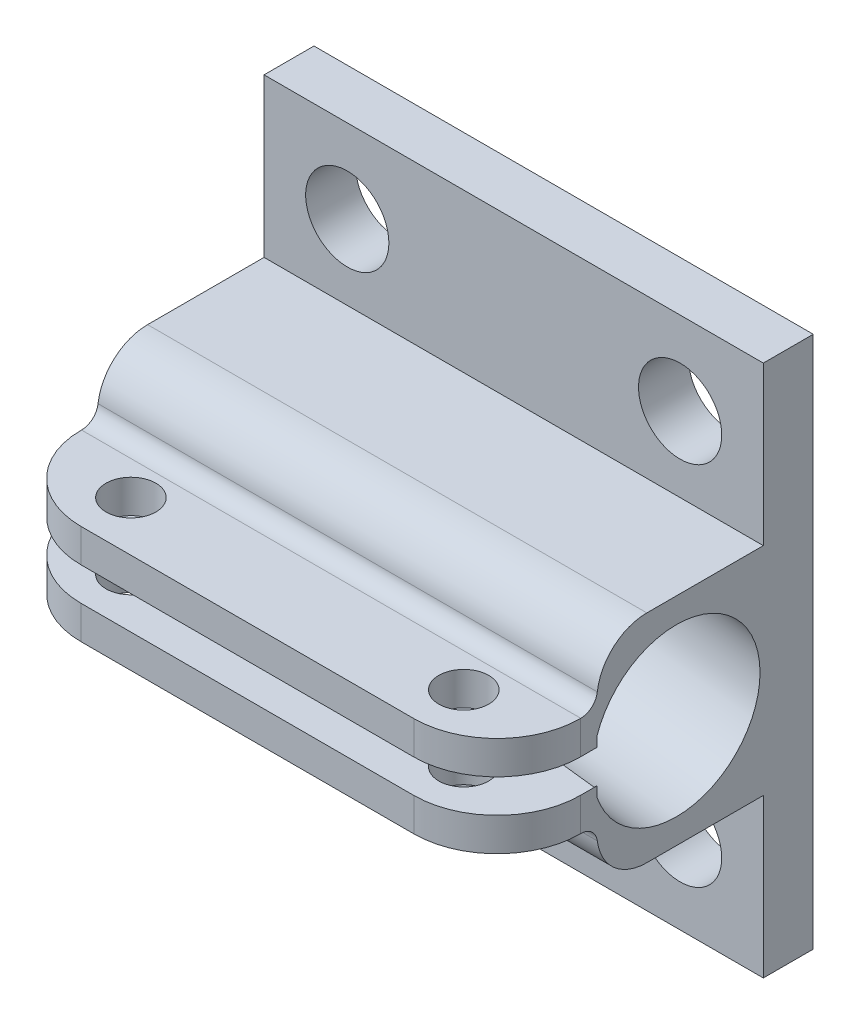
ISO-10303-21;
HEADER;
FILE_DESCRIPTION(('STEP AP214'),'2;1');
FILE_NAME('part.step','',(''),(''),'','','');
FILE_SCHEMA(('AUTOMOTIVE_DESIGN { 1 0 10303 214 1 1 1 1 }'));
ENDSEC;
DATA;
#1=APPLICATION_CONTEXT('core data for automotive mechanical design processes');
#2=APPLICATION_PROTOCOL_DEFINITION('international standard','automotive_design',2000,#1);
#3=PRODUCT_CONTEXT('',#1,'mechanical');
#4=PRODUCT('Part','Part','',(#3));
#5=PRODUCT_RELATED_PRODUCT_CATEGORY('part','',(#4));
#6=PRODUCT_DEFINITION_FORMATION('','',#4);
#7=PRODUCT_DEFINITION_CONTEXT('part definition',#1,'design');
#8=PRODUCT_DEFINITION('design','',#6,#7);
#9=PRODUCT_DEFINITION_SHAPE('','',#8);
#10=(LENGTH_UNIT() NAMED_UNIT(*) SI_UNIT(.MILLI.,.METRE.));
#11=(NAMED_UNIT(*) PLANE_ANGLE_UNIT() SI_UNIT($,.RADIAN.));
#12=(NAMED_UNIT(*) SI_UNIT($,.STERADIAN.) SOLID_ANGLE_UNIT());
#13=UNCERTAINTY_MEASURE_WITH_UNIT(LENGTH_MEASURE(1.E-05),#10,'distance_accuracy_value','');
#14=(GEOMETRIC_REPRESENTATION_CONTEXT(3) GLOBAL_UNCERTAINTY_ASSIGNED_CONTEXT((#13)) GLOBAL_UNIT_ASSIGNED_CONTEXT((#10,
#11,#12)) REPRESENTATION_CONTEXT('',''));
#15=CARTESIAN_POINT('',(0.,0.,0.));
#16=DIRECTION('',(0.,0.,1.));
#17=DIRECTION('',(1.,0.,0.));
#18=AXIS2_PLACEMENT_3D('',#15,#16,#17);
#19=CARTESIAN_POINT('',(-25.,16.26211357,66.8));
#20=DIRECTION('',(0.,1.,0.));
#21=DIRECTION('',(0.,0.,1.));
#22=AXIS2_PLACEMENT_3D('',#19,#20,#21);
#23=CYLINDRICAL_SURFACE('',#22,1.5);
#24=CARTESIAN_POINT('',(-25.,18.26211357,66.8));
#25=DIRECTION('',(0.,1.,0.));
#26=DIRECTION('',(0.,0.,1.));
#27=AXIS2_PLACEMENT_3D('',#24,#25,#26);
#28=CIRCLE('',#27,1.5);
#29=CARTESIAN_POINT('',(-25.,18.26211357,68.3));
#30=VERTEX_POINT('',#29);
#31=EDGE_CURVE('E28',#30,#30,#28,.T.);
#32=ORIENTED_EDGE('',*,*,#31,.T.);
#33=EDGE_LOOP('',(#32));
#34=FACE_BOUND('',#33,.T.);
#35=CARTESIAN_POINT('',(-25.,16.26211357,66.8));
#36=DIRECTION('',(0.,1.,0.));
#37=DIRECTION('',(0.,0.,1.));
#38=AXIS2_PLACEMENT_3D('',#35,#36,#37);
#39=CIRCLE('',#38,1.5);
#40=CARTESIAN_POINT('',(-25.,16.26211357,68.3));
#41=VERTEX_POINT('',#40);
#42=EDGE_CURVE('E260',#41,#41,#39,.F.);
#43=ORIENTED_EDGE('',*,*,#42,.T.);
#44=EDGE_LOOP('',(#43));
#45=FACE_BOUND('',#44,.T.);
#46=ADVANCED_FACE('F25',(#34,#45),#23,.F.);
#47=CARTESIAN_POINT('',(-5.,16.26211357,66.8));
#48=DIRECTION('',(0.,1.,0.));
#49=DIRECTION('',(0.,0.,1.));
#50=AXIS2_PLACEMENT_3D('',#47,#48,#49);
#51=CYLINDRICAL_SURFACE('',#50,1.5);
#52=CARTESIAN_POINT('',(-5.,18.26211357,66.8));
#53=DIRECTION('',(0.,1.,0.));
#54=DIRECTION('',(0.,0.,1.));
#55=AXIS2_PLACEMENT_3D('',#52,#53,#54);
#56=CIRCLE('',#55,1.5);
#57=CARTESIAN_POINT('',(-5.,18.26211357,68.3));
#58=VERTEX_POINT('',#57);
#59=EDGE_CURVE('E169',#58,#58,#56,.T.);
#60=ORIENTED_EDGE('',*,*,#59,.T.);
#61=EDGE_LOOP('',(#60));
#62=FACE_BOUND('',#61,.T.);
#63=CARTESIAN_POINT('',(-5.,16.26211357,66.8));
#64=DIRECTION('',(0.,1.,0.));
#65=DIRECTION('',(0.,0.,1.));
#66=AXIS2_PLACEMENT_3D('',#63,#64,#65);
#67=CIRCLE('',#66,1.5);
#68=CARTESIAN_POINT('',(-5.,16.26211357,68.3));
#69=VERTEX_POINT('',#68);
#70=EDGE_CURVE('E257',#69,#69,#67,.F.);
#71=ORIENTED_EDGE('',*,*,#70,.T.);
#72=EDGE_LOOP('',(#71));
#73=FACE_BOUND('',#72,.T.);
#74=ADVANCED_FACE('F628',(#62,#73),#51,.F.);
#75=CARTESIAN_POINT('',(0.,0.,69.8));
#76=DIRECTION('',(0.,0.,1.));
#77=DIRECTION('',(1.,0.,0.));
#78=AXIS2_PLACEMENT_3D('',#75,#76,#77);
#79=PLANE('',#78);
#80=DIRECTION('',(0.,1.,0.));
#81=VECTOR('',#80,1.);
#82=CARTESIAN_POINT('',(-5.,17.26211357,69.8));
#83=LINE('',#82,#81);
#84=CARTESIAN_POINT('',(-5.,16.26211357,69.8));
#85=VERTEX_POINT('',#84);
#86=CARTESIAN_POINT('',(-5.,18.26211357,69.8));
#87=VERTEX_POINT('',#86);
#88=EDGE_CURVE('E252',#85,#87,#83,.T.);
#89=ORIENTED_EDGE('',*,*,#88,.T.);
#90=DIRECTION('',(1.,0.,0.));
#91=VECTOR('',#90,1.);
#92=CARTESIAN_POINT('',(0.,18.26211357,69.8));
#93=LINE('',#92,#91);
#94=CARTESIAN_POINT('',(-25.,18.26211357,69.8));
#95=VERTEX_POINT('',#94);
#96=EDGE_CURVE('E286',#87,#95,#93,.F.);
#97=ORIENTED_EDGE('',*,*,#96,.T.);
#98=DIRECTION('',(0.,-1.,0.));
#99=VECTOR('',#98,1.);
#100=CARTESIAN_POINT('',(-25.,17.26211357,69.8));
#101=LINE('',#100,#99);
#102=CARTESIAN_POINT('',(-25.,16.26211357,69.8));
#103=VERTEX_POINT('',#102);
#104=EDGE_CURVE('E268',#95,#103,#101,.T.);
#105=ORIENTED_EDGE('',*,*,#104,.T.);
#106=DIRECTION('',(1.,0.,0.));
#107=VECTOR('',#106,1.);
#108=CARTESIAN_POINT('',(0.,16.26211357,69.8));
#109=LINE('',#108,#107);
#110=EDGE_CURVE('E267',#103,#85,#109,.T.);
#111=ORIENTED_EDGE('',*,*,#110,.T.);
#112=EDGE_LOOP('',(#89,#97,#105,#111));
#113=FACE_BOUND('',#112,.T.);
#114=ADVANCED_FACE('F625',(#113),#79,.T.);
#115=CARTESIAN_POINT('',(0.,18.26211357,0.));
#116=DIRECTION('',(0.,1.,0.));
#117=DIRECTION('',(0.,0.,1.));
#118=AXIS2_PLACEMENT_3D('',#115,#116,#117);
#119=PLANE('',#118);
#120=ORIENTED_EDGE('',*,*,#59,.F.);
#121=EDGE_LOOP('',(#120));
#122=FACE_BOUND('',#121,.T.);
#123=ORIENTED_EDGE('',*,*,#31,.F.);
#124=EDGE_LOOP('',(#123));
#125=FACE_BOUND('',#124,.T.);
#126=CARTESIAN_POINT('',(-25.,18.26211357,64.8));
#127=DIRECTION('',(0.,1.,0.));
#128=DIRECTION('',(0.,0.,1.));
#129=AXIS2_PLACEMENT_3D('',#126,#127,#128);
#130=CIRCLE('',#129,5.);
#131=CARTESIAN_POINT('',(-30.,18.26211357,64.8));
#132=VERTEX_POINT('',#131);
#133=EDGE_CURVE('E269',#132,#95,#130,.T.);
#134=ORIENTED_EDGE('',*,*,#133,.T.);
#135=ORIENTED_EDGE('',*,*,#96,.F.);
#136=CARTESIAN_POINT('',(-5.,18.26211357,64.8));
#137=DIRECTION('',(0.,1.,0.));
#138=DIRECTION('',(0.,0.,1.));
#139=AXIS2_PLACEMENT_3D('',#136,#137,#138);
#140=CIRCLE('',#139,5.);
#141=CARTESIAN_POINT('',(0.,18.26211357,64.8));
#142=VERTEX_POINT('',#141);
#143=EDGE_CURVE('E178',#87,#142,#140,.T.);
#144=ORIENTED_EDGE('',*,*,#143,.T.);
#145=DIRECTION('',(0.,0.,1.));
#146=VECTOR('',#145,1.);
#147=CARTESIAN_POINT('',(0.,18.26211357,0.));
#148=LINE('',#147,#146);
#149=CARTESIAN_POINT('',(0.,18.2621135658573,64.76862697));
#150=VERTEX_POINT('',#149);
#151=EDGE_CURVE('E290',#150,#142,#148,.T.);
#152=ORIENTED_EDGE('',*,*,#151,.F.);
#153=DIRECTION('',(1.,0.,0.));
#154=VECTOR('',#153,1.);
#155=CARTESIAN_POINT('',(-15.,18.2621135617147,64.76862697));
#156=LINE('',#155,#154);
#157=CARTESIAN_POINT('',(-30.,18.2621135658573,64.76862697));
#158=VERTEX_POINT('',#157);
#159=EDGE_CURVE('E165',#150,#158,#156,.F.);
#160=ORIENTED_EDGE('',*,*,#159,.T.);
#161=DIRECTION('',(0.,0.,1.));
#162=VECTOR('',#161,1.);
#163=CARTESIAN_POINT('',(-30.,18.26211357,0.));
#164=LINE('',#163,#162);
#165=EDGE_CURVE('E283',#132,#158,#164,.F.);
#166=ORIENTED_EDGE('',*,*,#165,.F.);
#167=EDGE_LOOP('',(#134,#135,#144,#152,#160,#166));
#168=FACE_BOUND('',#167,.T.);
#169=ADVANCED_FACE('F622',(#122,#125,#168),#119,.T.);
#170=CARTESIAN_POINT('',(0.,19.26211357,64.76862697));
#171=DIRECTION('',(-1.,0.,0.));
#172=DIRECTION('',(0.,0.,1.));
#173=AXIS2_PLACEMENT_3D('',#170,#171,#172);
#174=CYLINDRICAL_SURFACE('',#173,1.00000000828529);
#175=CARTESIAN_POINT('',(-30.,19.26211357,64.76862697));
#176=DIRECTION('',(-1.,0.,0.));
#177=DIRECTION('',(0.,0.,1.));
#178=AXIS2_PLACEMENT_3D('',#175,#176,#177);
#179=CIRCLE('',#178,1.00000000828529);
#180=CARTESIAN_POINT('',(-30.,19.1371135698417,63.7764702224938));
#181=VERTEX_POINT('',#180);
#182=EDGE_CURVE('E278',#158,#181,#179,.F.);
#183=ORIENTED_EDGE('',*,*,#182,.F.);
#184=ORIENTED_EDGE('',*,*,#159,.F.);
#185=CARTESIAN_POINT('',(0.,19.26211357,64.76862697));
#186=DIRECTION('',(-1.,0.,0.));
#187=DIRECTION('',(0.,0.,1.));
#188=AXIS2_PLACEMENT_3D('',#185,#186,#187);
#189=CIRCLE('',#188,1.00000000828529);
#190=CARTESIAN_POINT('',(0.,19.1371135698417,63.7764702224938));
#191=VERTEX_POINT('',#190);
#192=EDGE_CURVE('E158',#191,#150,#189,.T.);
#193=ORIENTED_EDGE('',*,*,#192,.F.);
#194=DIRECTION('',(-1.,0.,0.));
#195=VECTOR('',#194,1.);
#196=CARTESIAN_POINT('',(-15.,19.1371135706136,63.7764702248704));
#197=LINE('',#196,#195);
#198=EDGE_CURVE('E162',#191,#181,#197,.T.);
#199=ORIENTED_EDGE('',*,*,#198,.T.);
#200=EDGE_LOOP('',(#183,#184,#193,#199));
#201=FACE_BOUND('',#200,.T.);
#202=ADVANCED_FACE('F161',(#201),#174,.F.);
#203=CARTESIAN_POINT('',(0.,11.26211357,64.76862697));
#204=DIRECTION('',(-1.,0.,0.));
#205=DIRECTION('',(0.,0.,1.));
#206=AXIS2_PLACEMENT_3D('',#203,#204,#205);
#207=CYLINDRICAL_SURFACE('',#206,0.999999999999999);
#208=CARTESIAN_POINT('',(0.,11.26211357,64.76862697));
#209=DIRECTION('',(-1.,0.,0.));
#210=DIRECTION('',(0.,0.,1.));
#211=AXIS2_PLACEMENT_3D('',#208,#209,#210);
#212=CIRCLE('',#211,0.999999999999999);
#213=CARTESIAN_POINT('',(0.,12.26211357,64.76862697));
#214=VERTEX_POINT('',#213);
#215=CARTESIAN_POINT('',(0.,11.3871135699472,63.7764702241688));
#216=VERTEX_POINT('',#215);
#217=EDGE_CURVE('E273',#214,#216,#212,.T.);
#218=ORIENTED_EDGE('',*,*,#217,.F.);
#219=DIRECTION('',(1.,0.,0.));
#220=VECTOR('',#219,1.);
#221=CARTESIAN_POINT('',(0.,12.26211357,64.76862697));
#222=LINE('',#221,#220);
#223=CARTESIAN_POINT('',(-30.,12.26211357,64.76862697));
#224=VERTEX_POINT('',#223);
#225=EDGE_CURVE('E272',#214,#224,#222,.F.);
#226=ORIENTED_EDGE('',*,*,#225,.T.);
#227=CARTESIAN_POINT('',(-30.,11.26211357,64.76862697));
#228=DIRECTION('',(-1.,0.,0.));
#229=DIRECTION('',(0.,0.,1.));
#230=AXIS2_PLACEMENT_3D('',#227,#228,#229);
#231=CIRCLE('',#230,0.999999999999999);
#232=CARTESIAN_POINT('',(-30.,11.3871135699472,63.7764702241688));
#233=VERTEX_POINT('',#232);
#234=EDGE_CURVE('E276',#233,#224,#231,.F.);
#235=ORIENTED_EDGE('',*,*,#234,.F.);
#236=DIRECTION('',(1.,0.,0.));
#237=VECTOR('',#236,1.);
#238=CARTESIAN_POINT('',(-15.,11.38711357,63.77647022));
#239=LINE('',#238,#237);
#240=EDGE_CURVE('E234',#233,#216,#239,.T.);
#241=ORIENTED_EDGE('',*,*,#240,.T.);
#242=EDGE_LOOP('',(#218,#226,#235,#241));
#243=FACE_BOUND('',#242,.T.);
#244=ADVANCED_FACE('F550',(#243),#207,.F.);
#245=CARTESIAN_POINT('',(0.,12.26211357,0.));
#246=DIRECTION('',(0.,1.,0.));
#247=DIRECTION('',(0.,0.,1.));
#248=AXIS2_PLACEMENT_3D('',#245,#246,#247);
#249=PLANE('',#248);
#250=CARTESIAN_POINT('',(-5.,12.26211357,66.8));
#251=DIRECTION('',(0.,1.,0.));
#252=DIRECTION('',(0.,0.,1.));
#253=AXIS2_PLACEMENT_3D('',#250,#251,#252);
#254=CIRCLE('',#253,1.5);
#255=CARTESIAN_POINT('',(-5.,12.26211357,68.3));
#256=VERTEX_POINT('',#255);
#257=EDGE_CURVE('E231',#256,#256,#254,.T.);
#258=ORIENTED_EDGE('',*,*,#257,.T.);
#259=EDGE_LOOP('',(#258));
#260=FACE_BOUND('',#259,.T.);
#261=CARTESIAN_POINT('',(-25.,12.26211357,66.8));
#262=DIRECTION('',(0.,1.,0.));
#263=DIRECTION('',(0.,0.,1.));
#264=AXIS2_PLACEMENT_3D('',#261,#262,#263);
#265=CIRCLE('',#264,1.5);
#266=CARTESIAN_POINT('',(-25.,12.26211357,68.3));
#267=VERTEX_POINT('',#266);
#268=EDGE_CURVE('E235',#267,#267,#265,.T.);
#269=ORIENTED_EDGE('',*,*,#268,.T.);
#270=EDGE_LOOP('',(#269));
#271=FACE_BOUND('',#270,.T.);
#272=DIRECTION('',(0.,0.,1.));
#273=VECTOR('',#272,1.);
#274=CARTESIAN_POINT('',(0.,12.26211357,0.));
#275=LINE('',#274,#273);
#276=CARTESIAN_POINT('',(0.,12.26211357,64.8));
#277=VERTEX_POINT('',#276);
#278=EDGE_CURVE('E300',#277,#214,#275,.F.);
#279=ORIENTED_EDGE('',*,*,#278,.F.);
#280=CARTESIAN_POINT('',(-5.,12.26211357,64.8));
#281=DIRECTION('',(0.,1.,0.));
#282=DIRECTION('',(-1.,0.,0.));
#283=AXIS2_PLACEMENT_3D('',#280,#281,#282);
#284=CIRCLE('',#283,5.);
#285=CARTESIAN_POINT('',(-5.,12.26211357,69.8));
#286=VERTEX_POINT('',#285);
#287=EDGE_CURVE('E239',#277,#286,#284,.F.);
#288=ORIENTED_EDGE('',*,*,#287,.T.);
#289=DIRECTION('',(1.,0.,0.));
#290=VECTOR('',#289,1.);
#291=CARTESIAN_POINT('',(0.,12.26211357,69.8));
#292=LINE('',#291,#290);
#293=CARTESIAN_POINT('',(-25.,12.26211357,69.8));
#294=VERTEX_POINT('',#293);
#295=EDGE_CURVE('E238',#286,#294,#292,.F.);
#296=ORIENTED_EDGE('',*,*,#295,.T.);
#297=CARTESIAN_POINT('',(-25.,12.26211357,64.8));
#298=DIRECTION('',(0.,1.,0.));
#299=DIRECTION('',(0.,0.,1.));
#300=AXIS2_PLACEMENT_3D('',#297,#298,#299);
#301=CIRCLE('',#300,5.);
#302=CARTESIAN_POINT('',(-30.,12.26211357,64.8));
#303=VERTEX_POINT('',#302);
#304=EDGE_CURVE('E218',#294,#303,#301,.F.);
#305=ORIENTED_EDGE('',*,*,#304,.T.);
#306=DIRECTION('',(0.,0.,1.));
#307=VECTOR('',#306,1.);
#308=CARTESIAN_POINT('',(-30.,12.26211357,0.));
#309=LINE('',#308,#307);
#310=EDGE_CURVE('E275',#224,#303,#309,.T.);
#311=ORIENTED_EDGE('',*,*,#310,.F.);
#312=ORIENTED_EDGE('',*,*,#225,.F.);
#313=EDGE_LOOP('',(#279,#288,#296,#305,#311,#312));
#314=FACE_BOUND('',#313,.T.);
#315=ADVANCED_FACE('F470',(#260,#271,#314),#249,.F.);
#316=CARTESIAN_POINT('',(-5.,4.262113571,50.8));
#317=DIRECTION('',(0.,0.,1.));
#318=DIRECTION('',(1.,0.,0.));
#319=AXIS2_PLACEMENT_3D('',#316,#317,#318);
#320=CYLINDRICAL_SURFACE('',#319,2.5);
#321=CARTESIAN_POINT('',(-5.,4.262113571,53.8));
#322=DIRECTION('',(0.,0.,1.));
#323=DIRECTION('',(1.,0.,0.));
#324=AXIS2_PLACEMENT_3D('',#321,#322,#323);
#325=CIRCLE('',#324,2.5);
#326=CARTESIAN_POINT('',(-2.5,4.262113571,53.8));
#327=VERTEX_POINT('',#326);
#328=EDGE_CURVE('E227',#327,#327,#325,.T.);
#329=ORIENTED_EDGE('',*,*,#328,.T.);
#330=EDGE_LOOP('',(#329));
#331=FACE_BOUND('',#330,.T.);
#332=CARTESIAN_POINT('',(-5.,4.262113571,50.8));
#333=DIRECTION('',(0.,0.,1.));
#334=DIRECTION('',(1.,0.,0.));
#335=AXIS2_PLACEMENT_3D('',#332,#333,#334);
#336=CIRCLE('',#335,2.5);
#337=CARTESIAN_POINT('',(-2.5,4.262113571,50.8));
#338=VERTEX_POINT('',#337);
#339=EDGE_CURVE('E214',#338,#338,#336,.F.);
#340=ORIENTED_EDGE('',*,*,#339,.T.);
#341=EDGE_LOOP('',(#340));
#342=FACE_BOUND('',#341,.T.);
#343=ADVANCED_FACE('F600',(#331,#342),#320,.F.);
#344=CARTESIAN_POINT('',(-25.,4.262113571,50.8));
#345=DIRECTION('',(0.,0.,1.));
#346=DIRECTION('',(1.,0.,0.));
#347=AXIS2_PLACEMENT_3D('',#344,#345,#346);
#348=CYLINDRICAL_SURFACE('',#347,2.5);
#349=CARTESIAN_POINT('',(-25.,4.262113571,53.8));
#350=DIRECTION('',(0.,0.,1.));
#351=DIRECTION('',(1.,0.,0.));
#352=AXIS2_PLACEMENT_3D('',#349,#350,#351);
#353=CIRCLE('',#352,2.5);
#354=CARTESIAN_POINT('',(-22.5,4.262113571,53.8));
#355=VERTEX_POINT('',#354);
#356=EDGE_CURVE('E223',#355,#355,#353,.T.);
#357=ORIENTED_EDGE('',*,*,#356,.T.);
#358=EDGE_LOOP('',(#357));
#359=FACE_BOUND('',#358,.T.);
#360=CARTESIAN_POINT('',(-25.,4.262113571,50.8));
#361=DIRECTION('',(0.,0.,1.));
#362=DIRECTION('',(1.,0.,0.));
#363=AXIS2_PLACEMENT_3D('',#360,#361,#362);
#364=CIRCLE('',#363,2.5);
#365=CARTESIAN_POINT('',(-22.5,4.262113571,50.8));
#366=VERTEX_POINT('',#365);
#367=EDGE_CURVE('E211',#366,#366,#364,.F.);
#368=ORIENTED_EDGE('',*,*,#367,.T.);
#369=EDGE_LOOP('',(#368));
#370=FACE_BOUND('',#369,.T.);
#371=ADVANCED_FACE('F603',(#359,#370),#348,.F.);
#372=CARTESIAN_POINT('',(-5.,26.26211357,50.8));
#373=DIRECTION('',(0.,0.,1.));
#374=DIRECTION('',(1.,0.,0.));
#375=AXIS2_PLACEMENT_3D('',#372,#373,#374);
#376=CYLINDRICAL_SURFACE('',#375,2.5);
#377=CARTESIAN_POINT('',(-5.,26.26211357,53.8));
#378=DIRECTION('',(0.,0.,1.));
#379=DIRECTION('',(1.,0.,0.));
#380=AXIS2_PLACEMENT_3D('',#377,#378,#379);
#381=CIRCLE('',#380,2.5);
#382=CARTESIAN_POINT('',(-2.5,26.26211357,53.8));
#383=VERTEX_POINT('',#382);
#384=EDGE_CURVE('E246',#383,#383,#381,.T.);
#385=ORIENTED_EDGE('',*,*,#384,.T.);
#386=EDGE_LOOP('',(#385));
#387=FACE_BOUND('',#386,.T.);
#388=CARTESIAN_POINT('',(-5.,26.26211357,50.8));
#389=DIRECTION('',(0.,0.,1.));
#390=DIRECTION('',(1.,0.,0.));
#391=AXIS2_PLACEMENT_3D('',#388,#389,#390);
#392=CIRCLE('',#391,2.5);
#393=CARTESIAN_POINT('',(-2.5,26.26211357,50.8));
#394=VERTEX_POINT('',#393);
#395=EDGE_CURVE('E208',#394,#394,#392,.F.);
#396=ORIENTED_EDGE('',*,*,#395,.T.);
#397=EDGE_LOOP('',(#396));
#398=FACE_BOUND('',#397,.T.);
#399=ADVANCED_FACE('F611',(#387,#398),#376,.F.);
#400=CARTESIAN_POINT('',(-25.,26.26211357,50.8));
#401=DIRECTION('',(0.,0.,1.));
#402=DIRECTION('',(1.,0.,0.));
#403=AXIS2_PLACEMENT_3D('',#400,#401,#402);
#404=CYLINDRICAL_SURFACE('',#403,2.5);
#405=CARTESIAN_POINT('',(-25.,26.26211357,53.8));
#406=DIRECTION('',(0.,0.,1.));
#407=DIRECTION('',(1.,0.,0.));
#408=AXIS2_PLACEMENT_3D('',#405,#406,#407);
#409=CIRCLE('',#408,2.5);
#410=CARTESIAN_POINT('',(-22.5,26.26211357,53.8));
#411=VERTEX_POINT('',#410);
#412=EDGE_CURVE('E243',#411,#411,#409,.T.);
#413=ORIENTED_EDGE('',*,*,#412,.T.);
#414=EDGE_LOOP('',(#413));
#415=FACE_BOUND('',#414,.T.);
#416=CARTESIAN_POINT('',(-25.,26.26211357,50.8));
#417=DIRECTION('',(0.,0.,1.));
#418=DIRECTION('',(1.,0.,0.));
#419=AXIS2_PLACEMENT_3D('',#416,#417,#418);
#420=CIRCLE('',#419,2.5);
#421=CARTESIAN_POINT('',(-22.5,26.26211357,50.8));
#422=VERTEX_POINT('',#421);
#423=EDGE_CURVE('E204',#422,#422,#420,.F.);
#424=ORIENTED_EDGE('',*,*,#423,.T.);
#425=EDGE_LOOP('',(#424));
#426=FACE_BOUND('',#425,.T.);
#427=ADVANCED_FACE('F667',(#415,#426),#404,.F.);
#428=CARTESIAN_POINT('',(-25.,16.26211357,64.8));
#429=DIRECTION('',(0.,1.,0.));
#430=DIRECTION('',(0.,0.,1.));
#431=AXIS2_PLACEMENT_3D('',#428,#429,#430);
#432=CYLINDRICAL_SURFACE('',#431,5.);
#433=ORIENTED_EDGE('',*,*,#104,.F.);
#434=ORIENTED_EDGE('',*,*,#133,.F.);
#435=DIRECTION('',(0.,1.,0.));
#436=VECTOR('',#435,1.);
#437=CARTESIAN_POINT('',(-30.,0.,64.8));
#438=LINE('',#437,#436);
#439=CARTESIAN_POINT('',(-30.,16.26211357,64.8));
#440=VERTEX_POINT('',#439);
#441=EDGE_CURVE('E207',#132,#440,#438,.F.);
#442=ORIENTED_EDGE('',*,*,#441,.T.);
#443=CARTESIAN_POINT('',(-25.,16.26211357,64.8));
#444=DIRECTION('',(0.,1.,0.));
#445=DIRECTION('',(0.,0.,1.));
#446=AXIS2_PLACEMENT_3D('',#443,#444,#445);
#447=CIRCLE('',#446,5.);
#448=EDGE_CURVE('E264',#440,#103,#447,.T.);
#449=ORIENTED_EDGE('',*,*,#448,.T.);
#450=EDGE_LOOP('',(#433,#434,#442,#449));
#451=FACE_BOUND('',#450,.T.);
#452=ADVANCED_FACE('F641',(#451),#432,.T.);
#453=CARTESIAN_POINT('',(0.,16.26211357,0.));
#454=DIRECTION('',(0.,1.,0.));
#455=DIRECTION('',(0.,0.,1.));
#456=AXIS2_PLACEMENT_3D('',#453,#454,#455);
#457=PLANE('',#456);
#458=ORIENTED_EDGE('',*,*,#70,.F.);
#459=EDGE_LOOP('',(#458));
#460=FACE_BOUND('',#459,.T.);
#461=ORIENTED_EDGE('',*,*,#42,.F.);
#462=EDGE_LOOP('',(#461));
#463=FACE_BOUND('',#462,.T.);
#464=DIRECTION('',(-0.108519877096657,0.,0.99409427936938));
#465=VECTOR('',#464,1.);
#466=CARTESIAN_POINT('',(6.88267949947389,16.26211357,0.751344765661867));
#467=LINE('',#466,#465);
#468=CARTESIAN_POINT('',(-0.0167745580296194,16.26211357,63.9536628633682));
#469=VERTEX_POINT('',#468);
#470=CARTESIAN_POINT('',(6.62318999457995E-12,16.26211357,63.8000000000008));
#471=VERTEX_POINT('',#470);
#472=EDGE_CURVE('E256',#469,#471,#467,.F.);
#473=ORIENTED_EDGE('',*,*,#472,.T.);
#474=DIRECTION('',(0.,0.,1.));
#475=VECTOR('',#474,1.);
#476=CARTESIAN_POINT('',(0.,16.26211357,0.));
#477=LINE('',#476,#475);
#478=CARTESIAN_POINT('',(0.,16.26211357,64.8));
#479=VERTEX_POINT('',#478);
#480=EDGE_CURVE('E263',#479,#471,#477,.F.);
#481=ORIENTED_EDGE('',*,*,#480,.F.);
#482=CARTESIAN_POINT('',(-5.,16.26211357,64.8));
#483=DIRECTION('',(0.,1.,0.));
#484=DIRECTION('',(0.,0.,1.));
#485=AXIS2_PLACEMENT_3D('',#482,#483,#484);
#486=CIRCLE('',#485,5.);
#487=EDGE_CURVE('E253',#479,#85,#486,.F.);
#488=ORIENTED_EDGE('',*,*,#487,.T.);
#489=ORIENTED_EDGE('',*,*,#110,.F.);
#490=ORIENTED_EDGE('',*,*,#448,.F.);
#491=DIRECTION('',(0.,0.,-1.));
#492=VECTOR('',#491,1.);
#493=CARTESIAN_POINT('',(-30.,16.26211357,0.));
#494=LINE('',#493,#492);
#495=CARTESIAN_POINT('',(-30.,16.26211357,60.6805569811457));
#496=VERTEX_POINT('',#495);
#497=EDGE_CURVE('E367',#440,#496,#494,.T.);
#498=ORIENTED_EDGE('',*,*,#497,.T.);
#499=DIRECTION('',(-0.994094279363724,0.,-0.108519877148468));
#500=VECTOR('',#499,1.);
#501=CARTESIAN_POINT('',(-15.27420559833,16.26211357,62.28809198));
#502=LINE('',#501,#500);
#503=EDGE_CURVE('E201',#496,#469,#502,.F.);
#504=ORIENTED_EDGE('',*,*,#503,.T.);
#505=EDGE_LOOP('',(#473,#481,#488,#489,#490,#498,#504));
#506=FACE_BOUND('',#505,.T.);
#507=ADVANCED_FACE('F637',(#460,#463,#506),#457,.F.);
#508=CARTESIAN_POINT('',(6.88267949947389,0.,0.751344765661867));
#509=DIRECTION('',(-0.99409427936938,0.,-0.108519877096657));
#510=DIRECTION('',(-0.108519877096657,0.,0.99409427936938));
#511=AXIS2_PLACEMENT_3D('',#508,#509,#510);
#512=PLANE('',#511);
#513=DIRECTION('',(0.,1.,0.));
#514=VECTOR('',#513,1.);
#515=CARTESIAN_POINT('',(0.,0.,63.8));
#516=LINE('',#515,#514);
#517=CARTESIAN_POINT('',(0.,16.8402874125932,63.7999999963966));
#518=VERTEX_POINT('',#517);
#519=EDGE_CURVE('E191',#518,#471,#516,.F.);
#520=ORIENTED_EDGE('',*,*,#519,.T.);
#521=ORIENTED_EDGE('',*,*,#472,.F.);
#522=CARTESIAN_POINT('',(0.514862084429719,15.26211357,59.0836153056347));
#523=DIRECTION('',(-0.994094280142386,0.,-0.108519870015549));
#524=DIRECTION('',(-0.108519870015549,0.,0.994094280142386));
#525=AXIS2_PLACEMENT_3D('',#522,#523,#524);
#526=CIRCLE('',#525,5.00000001946822);
#527=EDGE_CURVE('E197',#469,#518,#526,.T.);
#528=ORIENTED_EDGE('',*,*,#527,.T.);
#529=EDGE_LOOP('',(#520,#521,#528));
#530=FACE_BOUND('',#529,.T.);
#531=ADVANCED_FACE('F640',(#530),#512,.T.);
#532=CARTESIAN_POINT('',(-5.,16.26211357,64.8));
#533=DIRECTION('',(0.,1.,0.));
#534=DIRECTION('',(0.,0.,1.));
#535=AXIS2_PLACEMENT_3D('',#532,#533,#534);
#536=CYLINDRICAL_SURFACE('',#535,5.);
#537=ORIENTED_EDGE('',*,*,#88,.F.);
#538=ORIENTED_EDGE('',*,*,#487,.F.);
#539=DIRECTION('',(0.,1.,0.));
#540=VECTOR('',#539,1.);
#541=CARTESIAN_POINT('',(0.,0.,64.8));
#542=LINE('',#541,#540);
#543=EDGE_CURVE('E186',#479,#142,#542,.T.);
#544=ORIENTED_EDGE('',*,*,#543,.T.);
#545=ORIENTED_EDGE('',*,*,#143,.F.);
#546=EDGE_LOOP('',(#537,#538,#544,#545));
#547=FACE_BOUND('',#546,.T.);
#548=ADVANCED_FACE('F654',(#547),#536,.T.);
#549=CARTESIAN_POINT('',(-30.,18.76211357,60.8));
#550=DIRECTION('',(1.,0.,0.));
#551=DIRECTION('',(0.,0.,-1.));
#552=AXIS2_PLACEMENT_3D('',#549,#550,#551);
#553=CYLINDRICAL_SURFACE('',#552,3.);
#554=DIRECTION('',(1.,0.,0.));
#555=VECTOR('',#554,1.);
#556=CARTESIAN_POINT('',(0.,21.76211357,60.8));
#557=LINE('',#556,#555);
#558=CARTESIAN_POINT('',(0.,21.76211357,60.8));
#559=VERTEX_POINT('',#558);
#560=CARTESIAN_POINT('',(-30.,21.76211357,60.8));
#561=VERTEX_POINT('',#560);
#562=EDGE_CURVE('E177',#559,#561,#557,.F.);
#563=ORIENTED_EDGE('',*,*,#562,.T.);
#564=CARTESIAN_POINT('',(-30.,18.76211357,60.8));
#565=DIRECTION('',(1.,0.,0.));
#566=DIRECTION('',(0.,0.,-1.));
#567=AXIS2_PLACEMENT_3D('',#564,#565,#566);
#568=CIRCLE('',#567,3.);
#569=EDGE_CURVE('E176',#561,#181,#568,.T.);
#570=ORIENTED_EDGE('',*,*,#569,.T.);
#571=ORIENTED_EDGE('',*,*,#198,.F.);
#572=CARTESIAN_POINT('',(0.,18.76211357,60.8));
#573=DIRECTION('',(1.,0.,0.));
#574=DIRECTION('',(0.,0.,-1.));
#575=AXIS2_PLACEMENT_3D('',#572,#573,#574);
#576=CIRCLE('',#575,3.);
#577=EDGE_CURVE('E173',#191,#559,#576,.F.);
#578=ORIENTED_EDGE('',*,*,#577,.T.);
#579=EDGE_LOOP('',(#563,#570,#571,#578));
#580=FACE_BOUND('',#579,.T.);
#581=ADVANCED_FACE('F172',(#580),#553,.T.);
#582=CARTESIAN_POINT('',(0.,21.76211357,0.));
#583=DIRECTION('',(0.,-1.,0.));
#584=DIRECTION('',(0.,0.,-1.));
#585=AXIS2_PLACEMENT_3D('',#582,#583,#584);
#586=PLANE('',#585);
#587=DIRECTION('',(0.,0.,1.));
#588=VECTOR('',#587,1.);
#589=CARTESIAN_POINT('',(0.,21.76211357,0.));
#590=LINE('',#589,#588);
#591=CARTESIAN_POINT('',(0.,21.76211357,53.8));
#592=VERTEX_POINT('',#591);
#593=EDGE_CURVE('E185',#559,#592,#590,.F.);
#594=ORIENTED_EDGE('',*,*,#593,.T.);
#595=DIRECTION('',(1.,0.,0.));
#596=VECTOR('',#595,1.);
#597=CARTESIAN_POINT('',(0.,21.76211357,53.8));
#598=LINE('',#597,#596);
#599=CARTESIAN_POINT('',(-30.,21.76211357,53.8));
#600=VERTEX_POINT('',#599);
#601=EDGE_CURVE('E249',#592,#600,#598,.F.);
#602=ORIENTED_EDGE('',*,*,#601,.T.);
#603=DIRECTION('',(0.,0.,-1.));
#604=VECTOR('',#603,1.);
#605=CARTESIAN_POINT('',(-30.,21.76211357,0.));
#606=LINE('',#605,#604);
#607=EDGE_CURVE('E203',#600,#561,#606,.F.);
#608=ORIENTED_EDGE('',*,*,#607,.T.);
#609=ORIENTED_EDGE('',*,*,#562,.F.);
#610=EDGE_LOOP('',(#594,#602,#608,#609));
#611=FACE_BOUND('',#610,.T.);
#612=ADVANCED_FACE('F528',(#611),#586,.F.);
#613=CARTESIAN_POINT('',(0.,0.,53.8));
#614=DIRECTION('',(0.,0.,1.));
#615=DIRECTION('',(1.,0.,0.));
#616=AXIS2_PLACEMENT_3D('',#613,#614,#615);
#617=PLANE('',#616);
#618=ORIENTED_EDGE('',*,*,#412,.F.);
#619=EDGE_LOOP('',(#618));
#620=FACE_BOUND('',#619,.T.);
#621=ORIENTED_EDGE('',*,*,#384,.F.);
#622=EDGE_LOOP('',(#621));
#623=FACE_BOUND('',#622,.T.);
#624=DIRECTION('',(0.,1.,0.));
#625=VECTOR('',#624,1.);
#626=CARTESIAN_POINT('',(0.,0.,53.8));
#627=LINE('',#626,#625);
#628=CARTESIAN_POINT('',(0.,31.26211357,53.8));
#629=VERTEX_POINT('',#628);
#630=EDGE_CURVE('E188',#592,#629,#627,.T.);
#631=ORIENTED_EDGE('',*,*,#630,.T.);
#632=DIRECTION('',(1.,0.,0.));
#633=VECTOR('',#632,1.);
#634=CARTESIAN_POINT('',(0.,31.26211357,53.8));
#635=LINE('',#634,#633);
#636=CARTESIAN_POINT('',(-30.,31.26211357,53.8));
#637=VERTEX_POINT('',#636);
#638=EDGE_CURVE('E242',#629,#637,#635,.F.);
#639=ORIENTED_EDGE('',*,*,#638,.T.);
#640=DIRECTION('',(0.,1.,0.));
#641=VECTOR('',#640,1.);
#642=CARTESIAN_POINT('',(-30.,0.,53.8));
#643=LINE('',#642,#641);
#644=EDGE_CURVE('E360',#637,#600,#643,.F.);
#645=ORIENTED_EDGE('',*,*,#644,.T.);
#646=ORIENTED_EDGE('',*,*,#601,.F.);
#647=EDGE_LOOP('',(#631,#639,#645,#646));
#648=FACE_BOUND('',#647,.T.);
#649=ADVANCED_FACE('F530',(#620,#623,#648),#617,.T.);
#650=CARTESIAN_POINT('',(0.,31.26211357,0.));
#651=DIRECTION('',(0.,1.,0.));
#652=DIRECTION('',(0.,0.,1.));
#653=AXIS2_PLACEMENT_3D('',#650,#651,#652);
#654=PLANE('',#653);
#655=DIRECTION('',(0.,0.,1.));
#656=VECTOR('',#655,1.);
#657=CARTESIAN_POINT('',(0.,31.26211357,0.));
#658=LINE('',#657,#656);
#659=CARTESIAN_POINT('',(0.,31.26211357,50.8));
#660=VERTEX_POINT('',#659);
#661=EDGE_CURVE('E418',#629,#660,#658,.F.);
#662=ORIENTED_EDGE('',*,*,#661,.T.);
#663=DIRECTION('',(1.,0.,0.));
#664=VECTOR('',#663,1.);
#665=CARTESIAN_POINT('',(0.,31.26211357,50.8));
#666=LINE('',#665,#664);
#667=CARTESIAN_POINT('',(-30.,31.26211357,50.8));
#668=VERTEX_POINT('',#667);
#669=EDGE_CURVE('E217',#660,#668,#666,.F.);
#670=ORIENTED_EDGE('',*,*,#669,.T.);
#671=DIRECTION('',(0.,0.,-1.));
#672=VECTOR('',#671,1.);
#673=CARTESIAN_POINT('',(-30.,31.26211357,0.));
#674=LINE('',#673,#672);
#675=EDGE_CURVE('E366',#668,#637,#674,.F.);
#676=ORIENTED_EDGE('',*,*,#675,.T.);
#677=ORIENTED_EDGE('',*,*,#638,.F.);
#678=EDGE_LOOP('',(#662,#670,#676,#677));
#679=FACE_BOUND('',#678,.T.);
#680=ADVANCED_FACE('F535',(#679),#654,.T.);
#681=CARTESIAN_POINT('',(-5.,12.26211357,64.8));
#682=DIRECTION('',(0.,1.,0.));
#683=DIRECTION('',(-1.,0.,0.));
#684=AXIS2_PLACEMENT_3D('',#681,#682,#683);
#685=CYLINDRICAL_SURFACE('',#684,5.);
#686=DIRECTION('',(0.,1.,0.));
#687=VECTOR('',#686,1.);
#688=CARTESIAN_POINT('',(-5.,0.,69.8));
#689=LINE('',#688,#687);
#690=CARTESIAN_POINT('',(-5.,14.26211357,69.8));
#691=VERTEX_POINT('',#690);
#692=EDGE_CURVE('E241',#691,#286,#689,.F.);
#693=ORIENTED_EDGE('',*,*,#692,.T.);
#694=ORIENTED_EDGE('',*,*,#287,.F.);
#695=DIRECTION('',(0.,1.,0.));
#696=VECTOR('',#695,1.);
#697=CARTESIAN_POINT('',(0.,0.,64.8));
#698=LINE('',#697,#696);
#699=CARTESIAN_POINT('',(0.,14.26211357,64.8));
#700=VERTEX_POINT('',#699);
#701=EDGE_CURVE('E200',#277,#700,#698,.T.);
#702=ORIENTED_EDGE('',*,*,#701,.T.);
#703=CARTESIAN_POINT('',(-5.,14.26211357,64.8));
#704=DIRECTION('',(0.,1.,0.));
#705=DIRECTION('',(-1.,0.,0.));
#706=AXIS2_PLACEMENT_3D('',#703,#704,#705);
#707=CIRCLE('',#706,5.);
#708=EDGE_CURVE('E323',#700,#691,#707,.F.);
#709=ORIENTED_EDGE('',*,*,#708,.T.);
#710=EDGE_LOOP('',(#693,#694,#702,#709));
#711=FACE_BOUND('',#710,.T.);
#712=ADVANCED_FACE('F546',(#711),#685,.T.);
#713=CARTESIAN_POINT('',(0.,0.,69.8));
#714=DIRECTION('',(0.,0.,1.));
#715=DIRECTION('',(1.,0.,0.));
#716=AXIS2_PLACEMENT_3D('',#713,#714,#715);
#717=PLANE('',#716);
#718=ORIENTED_EDGE('',*,*,#692,.F.);
#719=DIRECTION('',(1.,0.,0.));
#720=VECTOR('',#719,1.);
#721=CARTESIAN_POINT('',(0.,14.26211357,69.8));
#722=LINE('',#721,#720);
#723=CARTESIAN_POINT('',(-25.,14.26211357,69.8));
#724=VERTEX_POINT('',#723);
#725=EDGE_CURVE('E322',#691,#724,#722,.F.);
#726=ORIENTED_EDGE('',*,*,#725,.T.);
#727=DIRECTION('',(0.,-1.,0.));
#728=VECTOR('',#727,1.);
#729=CARTESIAN_POINT('',(-25.,13.26211357,69.8));
#730=LINE('',#729,#728);
#731=EDGE_CURVE('E222',#724,#294,#730,.T.);
#732=ORIENTED_EDGE('',*,*,#731,.T.);
#733=ORIENTED_EDGE('',*,*,#295,.F.);
#734=EDGE_LOOP('',(#718,#726,#732,#733));
#735=FACE_BOUND('',#734,.T.);
#736=ADVANCED_FACE('F544',(#735),#717,.T.);
#737=CARTESIAN_POINT('',(-25.,12.26211357,66.8));
#738=DIRECTION('',(0.,1.,0.));
#739=DIRECTION('',(0.,0.,1.));
#740=AXIS2_PLACEMENT_3D('',#737,#738,#739);
#741=CYLINDRICAL_SURFACE('',#740,1.5);
#742=ORIENTED_EDGE('',*,*,#268,.F.);
#743=EDGE_LOOP('',(#742));
#744=FACE_BOUND('',#743,.T.);
#745=CARTESIAN_POINT('',(-25.,14.26211357,66.8));
#746=DIRECTION('',(0.,1.,0.));
#747=DIRECTION('',(0.,0.,1.));
#748=AXIS2_PLACEMENT_3D('',#745,#746,#747);
#749=CIRCLE('',#748,1.5);
#750=CARTESIAN_POINT('',(-25.,14.26211357,68.3));
#751=VERTEX_POINT('',#750);
#752=EDGE_CURVE('E318',#751,#751,#749,.T.);
#753=ORIENTED_EDGE('',*,*,#752,.T.);
#754=EDGE_LOOP('',(#753));
#755=FACE_BOUND('',#754,.T.);
#756=ADVANCED_FACE('F563',(#744,#755),#741,.F.);
#757=CARTESIAN_POINT('',(-5.,12.26211357,66.8));
#758=DIRECTION('',(0.,1.,0.));
#759=DIRECTION('',(0.,0.,1.));
#760=AXIS2_PLACEMENT_3D('',#757,#758,#759);
#761=CYLINDRICAL_SURFACE('',#760,1.5);
#762=ORIENTED_EDGE('',*,*,#257,.F.);
#763=EDGE_LOOP('',(#762));
#764=FACE_BOUND('',#763,.T.);
#765=CARTESIAN_POINT('',(-5.,14.26211357,66.8));
#766=DIRECTION('',(0.,1.,0.));
#767=DIRECTION('',(0.,0.,1.));
#768=AXIS2_PLACEMENT_3D('',#765,#766,#767);
#769=CIRCLE('',#768,1.5);
#770=CARTESIAN_POINT('',(-5.,14.26211357,68.3));
#771=VERTEX_POINT('',#770);
#772=EDGE_CURVE('E315',#771,#771,#769,.T.);
#773=ORIENTED_EDGE('',*,*,#772,.T.);
#774=EDGE_LOOP('',(#773));
#775=FACE_BOUND('',#774,.T.);
#776=ADVANCED_FACE('F555',(#764,#775),#761,.F.);
#777=CARTESIAN_POINT('',(-30.,11.76211357,60.8));
#778=DIRECTION('',(1.,0.,0.));
#779=DIRECTION('',(0.,1.,0.));
#780=AXIS2_PLACEMENT_3D('',#777,#778,#779);
#781=CYLINDRICAL_SURFACE('',#780,2.99999999509115);
#782=DIRECTION('',(1.,0.,0.));
#783=VECTOR('',#782,1.);
#784=CARTESIAN_POINT('',(0.,8.762113571,60.8));
#785=LINE('',#784,#783);
#786=CARTESIAN_POINT('',(-30.,8.762113571,60.8));
#787=VERTEX_POINT('',#786);
#788=CARTESIAN_POINT('',(0.,8.762113571,60.8));
#789=VERTEX_POINT('',#788);
#790=EDGE_CURVE('E396',#787,#789,#785,.T.);
#791=ORIENTED_EDGE('',*,*,#790,.T.);
#792=CARTESIAN_POINT('',(0.,11.76211357,60.8));
#793=DIRECTION('',(1.,0.,0.));
#794=DIRECTION('',(0.,1.,0.));
#795=AXIS2_PLACEMENT_3D('',#792,#793,#794);
#796=CIRCLE('',#795,2.99999999509115);
#797=EDGE_CURVE('E195',#789,#216,#796,.F.);
#798=ORIENTED_EDGE('',*,*,#797,.T.);
#799=ORIENTED_EDGE('',*,*,#240,.F.);
#800=CARTESIAN_POINT('',(-30.,11.76211357,60.8));
#801=DIRECTION('',(1.,0.,0.));
#802=DIRECTION('',(0.,1.,0.));
#803=AXIS2_PLACEMENT_3D('',#800,#801,#802);
#804=CIRCLE('',#803,2.99999999509115);
#805=EDGE_CURVE('E312',#233,#787,#804,.T.);
#806=ORIENTED_EDGE('',*,*,#805,.T.);
#807=EDGE_LOOP('',(#791,#798,#799,#806));
#808=FACE_BOUND('',#807,.T.);
#809=ADVANCED_FACE('F553',(#808),#781,.T.);
#810=CARTESIAN_POINT('',(0.,8.762113571,0.));
#811=DIRECTION('',(0.,1.,0.));
#812=DIRECTION('',(0.,0.,1.));
#813=AXIS2_PLACEMENT_3D('',#810,#811,#812);
#814=PLANE('',#813);
#815=DIRECTION('',(0.,0.,-1.));
#816=VECTOR('',#815,1.);
#817=CARTESIAN_POINT('',(-30.,8.762113571,0.));
#818=LINE('',#817,#816);
#819=CARTESIAN_POINT('',(-30.,8.762113571,53.8));
#820=VERTEX_POINT('',#819);
#821=EDGE_CURVE('E314',#787,#820,#818,.T.);
#822=ORIENTED_EDGE('',*,*,#821,.T.);
#823=DIRECTION('',(1.,0.,0.));
#824=VECTOR('',#823,1.);
#825=CARTESIAN_POINT('',(0.,8.762113571,53.8));
#826=LINE('',#825,#824);
#827=CARTESIAN_POINT('',(0.,8.762113571,53.8));
#828=VERTEX_POINT('',#827);
#829=EDGE_CURVE('E230',#820,#828,#826,.T.);
#830=ORIENTED_EDGE('',*,*,#829,.T.);
#831=DIRECTION('',(0.,0.,1.));
#832=VECTOR('',#831,1.);
#833=CARTESIAN_POINT('',(0.,8.762113571,0.));
#834=LINE('',#833,#832);
#835=EDGE_CURVE('E335',#828,#789,#834,.T.);
#836=ORIENTED_EDGE('',*,*,#835,.T.);
#837=ORIENTED_EDGE('',*,*,#790,.F.);
#838=EDGE_LOOP('',(#822,#830,#836,#837));
#839=FACE_BOUND('',#838,.T.);
#840=ADVANCED_FACE('F493',(#839),#814,.F.);
#841=CARTESIAN_POINT('',(0.,0.,53.8));
#842=DIRECTION('',(0.,0.,1.));
#843=DIRECTION('',(1.,0.,0.));
#844=AXIS2_PLACEMENT_3D('',#841,#842,#843);
#845=PLANE('',#844);
#846=ORIENTED_EDGE('',*,*,#356,.F.);
#847=EDGE_LOOP('',(#846));
#848=FACE_BOUND('',#847,.T.);
#849=ORIENTED_EDGE('',*,*,#328,.F.);
#850=EDGE_LOOP('',(#849));
#851=FACE_BOUND('',#850,.T.);
#852=DIRECTION('',(0.,1.,0.));
#853=VECTOR('',#852,1.);
#854=CARTESIAN_POINT('',(-30.,0.,53.8));
#855=LINE('',#854,#853);
#856=CARTESIAN_POINT('',(-30.,-0.7378864288,53.8));
#857=VERTEX_POINT('',#856);
#858=EDGE_CURVE('E383',#820,#857,#855,.F.);
#859=ORIENTED_EDGE('',*,*,#858,.T.);
#860=DIRECTION('',(1.,0.,0.));
#861=VECTOR('',#860,1.);
#862=CARTESIAN_POINT('',(0.,-0.7378864288,53.8));
#863=LINE('',#862,#861);
#864=CARTESIAN_POINT('',(0.,-0.7378864288,53.8));
#865=VERTEX_POINT('',#864);
#866=EDGE_CURVE('E226',#857,#865,#863,.T.);
#867=ORIENTED_EDGE('',*,*,#866,.T.);
#868=DIRECTION('',(0.,1.,0.));
#869=VECTOR('',#868,1.);
#870=CARTESIAN_POINT('',(0.,0.,53.8));
#871=LINE('',#870,#869);
#872=EDGE_CURVE('E345',#865,#828,#871,.T.);
#873=ORIENTED_EDGE('',*,*,#872,.T.);
#874=ORIENTED_EDGE('',*,*,#829,.F.);
#875=EDGE_LOOP('',(#859,#867,#873,#874));
#876=FACE_BOUND('',#875,.T.);
#877=ADVANCED_FACE('F498',(#848,#851,#876),#845,.T.);
#878=CARTESIAN_POINT('',(0.,-0.7378864288,0.));
#879=DIRECTION('',(0.,-1.,0.));
#880=DIRECTION('',(0.,0.,-1.));
#881=AXIS2_PLACEMENT_3D('',#878,#879,#880);
#882=PLANE('',#881);
#883=DIRECTION('',(0.,0.,-1.));
#884=VECTOR('',#883,1.);
#885=CARTESIAN_POINT('',(-30.,-0.7378864288,0.));
#886=LINE('',#885,#884);
#887=CARTESIAN_POINT('',(-30.,-0.7378864288,50.8));
#888=VERTEX_POINT('',#887);
#889=EDGE_CURVE('E379',#857,#888,#886,.T.);
#890=ORIENTED_EDGE('',*,*,#889,.T.);
#891=DIRECTION('',(1.,0.,0.));
#892=VECTOR('',#891,1.);
#893=CARTESIAN_POINT('',(0.,-0.7378864288,50.8));
#894=LINE('',#893,#892);
#895=CARTESIAN_POINT('',(0.,-0.7378864288,50.8));
#896=VERTEX_POINT('',#895);
#897=EDGE_CURVE('E221',#888,#896,#894,.T.);
#898=ORIENTED_EDGE('',*,*,#897,.T.);
#899=DIRECTION('',(0.,0.,1.));
#900=VECTOR('',#899,1.);
#901=CARTESIAN_POINT('',(0.,-0.7378864288,0.));
#902=LINE('',#901,#900);
#903=EDGE_CURVE('E408',#896,#865,#902,.T.);
#904=ORIENTED_EDGE('',*,*,#903,.T.);
#905=ORIENTED_EDGE('',*,*,#866,.F.);
#906=EDGE_LOOP('',(#890,#898,#904,#905));
#907=FACE_BOUND('',#906,.T.);
#908=ADVANCED_FACE('F506',(#907),#882,.T.);
#909=CARTESIAN_POINT('',(-25.,12.26211357,64.8));
#910=DIRECTION('',(0.,1.,0.));
#911=DIRECTION('',(0.,0.,1.));
#912=AXIS2_PLACEMENT_3D('',#909,#910,#911);
#913=CYLINDRICAL_SURFACE('',#912,5.);
#914=ORIENTED_EDGE('',*,*,#731,.F.);
#915=CARTESIAN_POINT('',(-25.,14.26211357,64.8));
#916=DIRECTION('',(0.,1.,0.));
#917=DIRECTION('',(0.,0.,1.));
#918=AXIS2_PLACEMENT_3D('',#915,#916,#917);
#919=CIRCLE('',#918,5.);
#920=CARTESIAN_POINT('',(-30.,14.26211357,64.8));
#921=VERTEX_POINT('',#920);
#922=EDGE_CURVE('E321',#724,#921,#919,.F.);
#923=ORIENTED_EDGE('',*,*,#922,.T.);
#924=DIRECTION('',(0.,1.,0.));
#925=VECTOR('',#924,1.);
#926=CARTESIAN_POINT('',(-30.,0.,64.8));
#927=LINE('',#926,#925);
#928=EDGE_CURVE('E311',#921,#303,#927,.F.);
#929=ORIENTED_EDGE('',*,*,#928,.T.);
#930=ORIENTED_EDGE('',*,*,#304,.F.);
#931=EDGE_LOOP('',(#914,#923,#929,#930));
#932=FACE_BOUND('',#931,.T.);
#933=ADVANCED_FACE('F474',(#932),#913,.T.);
#934=CARTESIAN_POINT('',(0.,0.,50.8));
#935=DIRECTION('',(0.,0.,1.));
#936=DIRECTION('',(1.,0.,0.));
#937=AXIS2_PLACEMENT_3D('',#934,#935,#936);
#938=PLANE('',#937);
#939=ORIENTED_EDGE('',*,*,#423,.F.);
#940=EDGE_LOOP('',(#939));
#941=FACE_BOUND('',#940,.T.);
#942=ORIENTED_EDGE('',*,*,#395,.F.);
#943=EDGE_LOOP('',(#942));
#944=FACE_BOUND('',#943,.T.);
#945=ORIENTED_EDGE('',*,*,#367,.F.);
#946=EDGE_LOOP('',(#945));
#947=FACE_BOUND('',#946,.T.);
#948=ORIENTED_EDGE('',*,*,#339,.F.);
#949=EDGE_LOOP('',(#948));
#950=FACE_BOUND('',#949,.T.);
#951=DIRECTION('',(0.,1.,0.));
#952=VECTOR('',#951,1.);
#953=CARTESIAN_POINT('',(-30.,0.,50.8));
#954=LINE('',#953,#952);
#955=CARTESIAN_POINT('',(-30.,16.1349528668826,50.8));
#956=VERTEX_POINT('',#955);
#957=EDGE_CURVE('E363',#956,#668,#954,.T.);
#958=ORIENTED_EDGE('',*,*,#957,.T.);
#959=ORIENTED_EDGE('',*,*,#669,.F.);
#960=DIRECTION('',(0.,1.,0.));
#961=VECTOR('',#960,1.);
#962=CARTESIAN_POINT('',(0.,0.,50.8));
#963=LINE('',#962,#961);
#964=EDGE_CURVE('E413',#660,#896,#963,.F.);
#965=ORIENTED_EDGE('',*,*,#964,.T.);
#966=ORIENTED_EDGE('',*,*,#897,.F.);
#967=DIRECTION('',(0.,1.,0.));
#968=VECTOR('',#967,1.);
#969=CARTESIAN_POINT('',(-30.,0.,50.8));
#970=LINE('',#969,#968);
#971=CARTESIAN_POINT('',(-30.,14.3892742731174,50.8));
#972=VERTEX_POINT('',#971);
#973=EDGE_CURVE('E382',#888,#972,#970,.T.);
#974=ORIENTED_EDGE('',*,*,#973,.T.);
#975=CARTESIAN_POINT('',(-75.367044086777,15.26211357,50.8));
#976=DIRECTION('',(0.,0.,1.));
#977=DIRECTION('',(-1.,0.,0.));
#978=AXIS2_PLACEMENT_3D('',#975,#976,#977);
#979=ELLIPSE('',#978,46.0745115091238,5.);
#980=EDGE_CURVE('E309',#972,#956,#979,.T.);
#981=ORIENTED_EDGE('',*,*,#980,.T.);
#982=EDGE_LOOP('',(#958,#959,#965,#966,#974,#981));
#983=FACE_BOUND('',#982,.T.);
#984=ADVANCED_FACE('F510',(#941,#944,#947,#950,#983),#938,.F.);
#985=CARTESIAN_POINT('',(-30.,0.,0.));
#986=DIRECTION('',(1.,0.,0.));
#987=DIRECTION('',(0.,0.,-1.));
#988=AXIS2_PLACEMENT_3D('',#985,#986,#987);
#989=PLANE('',#988);
#990=ORIENTED_EDGE('',*,*,#607,.F.);
#991=ORIENTED_EDGE('',*,*,#644,.F.);
#992=ORIENTED_EDGE('',*,*,#675,.F.);
#993=ORIENTED_EDGE('',*,*,#957,.F.);
#994=CARTESIAN_POINT('',(-30.,15.26211357,55.7524736492614));
#995=DIRECTION('',(1.,0.,0.));
#996=DIRECTION('',(0.,0.,-1.));
#997=AXIS2_PLACEMENT_3D('',#994,#995,#996);
#998=ELLIPSE('',#997,5.02970402292611,5.);
#999=EDGE_CURVE('E307',#956,#496,#998,.T.);
#1000=ORIENTED_EDGE('',*,*,#999,.T.);
#1001=ORIENTED_EDGE('',*,*,#497,.F.);
#1002=ORIENTED_EDGE('',*,*,#441,.F.);
#1003=ORIENTED_EDGE('',*,*,#165,.T.);
#1004=ORIENTED_EDGE('',*,*,#182,.T.);
#1005=ORIENTED_EDGE('',*,*,#569,.F.);
#1006=EDGE_LOOP('',(#990,#991,#992,#993,#1000,#1001,#1002,#1003,#1004,#1005));
#1007=FACE_BOUND('',#1006,.T.);
#1008=ADVANCED_FACE('F582',(#1007),#989,.F.);
#1009=CARTESIAN_POINT('',(0.,0.,0.));
#1010=DIRECTION('',(-1.,0.,0.));
#1011=DIRECTION('',(0.,0.,1.));
#1012=AXIS2_PLACEMENT_3D('',#1009,#1010,#1011);
#1013=PLANE('',#1012);
#1014=ORIENTED_EDGE('',*,*,#835,.F.);
#1015=ORIENTED_EDGE('',*,*,#872,.F.);
#1016=ORIENTED_EDGE('',*,*,#903,.F.);
#1017=ORIENTED_EDGE('',*,*,#964,.F.);
#1018=ORIENTED_EDGE('',*,*,#661,.F.);
#1019=ORIENTED_EDGE('',*,*,#630,.F.);
#1020=ORIENTED_EDGE('',*,*,#593,.F.);
#1021=ORIENTED_EDGE('',*,*,#577,.F.);
#1022=ORIENTED_EDGE('',*,*,#192,.T.);
#1023=ORIENTED_EDGE('',*,*,#151,.T.);
#1024=ORIENTED_EDGE('',*,*,#543,.F.);
#1025=ORIENTED_EDGE('',*,*,#480,.T.);
#1026=ORIENTED_EDGE('',*,*,#519,.F.);
#1027=CARTESIAN_POINT('',(0.,15.26211357,59.0274106099692));
#1028=DIRECTION('',(-1.,0.,0.));
#1029=DIRECTION('',(0.,0.,-1.));
#1030=AXIS2_PLACEMENT_3D('',#1027,#1028,#1029);
#1031=ELLIPSE('',#1030,5.02970402292613,5.00000000000001);
#1032=CARTESIAN_POINT('',(0.,13.6839398060898,63.8000000020863));
#1033=VERTEX_POINT('',#1032);
#1034=EDGE_CURVE('E304',#518,#1033,#1031,.T.);
#1035=ORIENTED_EDGE('',*,*,#1034,.T.);
#1036=DIRECTION('',(0.,1.,0.));
#1037=VECTOR('',#1036,1.);
#1038=CARTESIAN_POINT('',(0.,0.,63.8));
#1039=LINE('',#1038,#1037);
#1040=CARTESIAN_POINT('',(0.,14.26211357,63.8000000000001));
#1041=VERTEX_POINT('',#1040);
#1042=EDGE_CURVE('E352',#1041,#1033,#1039,.F.);
#1043=ORIENTED_EDGE('',*,*,#1042,.F.);
#1044=DIRECTION('',(0.,0.,-1.));
#1045=VECTOR('',#1044,1.);
#1046=CARTESIAN_POINT('',(0.,14.26211357,0.));
#1047=LINE('',#1046,#1045);
#1048=EDGE_CURVE('E324',#1041,#700,#1047,.F.);
#1049=ORIENTED_EDGE('',*,*,#1048,.T.);
#1050=ORIENTED_EDGE('',*,*,#701,.F.);
#1051=ORIENTED_EDGE('',*,*,#278,.T.);
#1052=ORIENTED_EDGE('',*,*,#217,.T.);
#1053=ORIENTED_EDGE('',*,*,#797,.F.);
#1054=EDGE_LOOP('',(#1014,#1015,#1016,#1017,#1018,#1019,#1020,#1021,#1022,#1023,#1024,#1025,
#1026,#1035,#1043,#1049,#1050,#1051,#1052,#1053));
#1055=FACE_BOUND('',#1054,.T.);
#1056=ADVANCED_FACE('F182',(#1055),#1013,.F.);
#1057=CARTESIAN_POINT('',(0.,14.26211357,0.));
#1058=DIRECTION('',(0.,-1.,0.));
#1059=DIRECTION('',(0.,0.,-1.));
#1060=AXIS2_PLACEMENT_3D('',#1057,#1058,#1059);
#1061=PLANE('',#1060);
#1062=ORIENTED_EDGE('',*,*,#772,.F.);
#1063=EDGE_LOOP('',(#1062));
#1064=FACE_BOUND('',#1063,.T.);
#1065=ORIENTED_EDGE('',*,*,#752,.F.);
#1066=EDGE_LOOP('',(#1065));
#1067=FACE_BOUND('',#1066,.T.);
#1068=DIRECTION('',(0.994094279986788,7.02422883874969E-09,0.108519871440895));
#1069=VECTOR('',#1068,1.);
#1070=CARTESIAN_POINT('',(-15.2742055602975,14.2621134876661,62.2880919472579));
#1071=LINE('',#1070,#1069);
#1072=CARTESIAN_POINT('',(-0.0167745442405662,14.2621135827372,63.9536627921106));
#1073=VERTEX_POINT('',#1072);
#1074=CARTESIAN_POINT('',(-30.,14.2621134768071,60.6805569954826));
#1075=VERTEX_POINT('',#1074);
#1076=EDGE_CURVE('E303',#1073,#1075,#1071,.F.);
#1077=ORIENTED_EDGE('',*,*,#1076,.T.);
#1078=DIRECTION('',(0.,0.,-1.));
#1079=VECTOR('',#1078,1.);
#1080=CARTESIAN_POINT('',(-30.,14.26211357,0.));
#1081=LINE('',#1080,#1079);
#1082=EDGE_CURVE('E374',#1075,#921,#1081,.F.);
#1083=ORIENTED_EDGE('',*,*,#1082,.T.);
#1084=ORIENTED_EDGE('',*,*,#922,.F.);
#1085=ORIENTED_EDGE('',*,*,#725,.F.);
#1086=ORIENTED_EDGE('',*,*,#708,.F.);
#1087=ORIENTED_EDGE('',*,*,#1048,.F.);
#1088=DIRECTION('',(0.108519875173038,0.,-0.994094279579371));
#1089=VECTOR('',#1088,1.);
#1090=CARTESIAN_POINT('',(-0.01677454668,14.26211357,63.95366292));
#1091=LINE('',#1090,#1089);
#1092=EDGE_CURVE('E43',#1073,#1041,#1091,.T.);
#1093=ORIENTED_EDGE('',*,*,#1092,.F.);
#1094=EDGE_LOOP('',(#1077,#1083,#1084,#1085,#1086,#1087,#1093));
#1095=FACE_BOUND('',#1094,.T.);
#1096=ADVANCED_FACE('F478',(#1064,#1067,#1095),#1061,.F.);
#1097=CARTESIAN_POINT('',(-30.,0.,0.));
#1098=DIRECTION('',(1.,0.,0.));
#1099=DIRECTION('',(0.,0.,-1.));
#1100=AXIS2_PLACEMENT_3D('',#1097,#1098,#1099);
#1101=PLANE('',#1100);
#1102=ORIENTED_EDGE('',*,*,#928,.F.);
#1103=ORIENTED_EDGE('',*,*,#1082,.F.);
#1104=CARTESIAN_POINT('',(-30.,15.26211357,55.7524736492614));
#1105=DIRECTION('',(1.,0.,0.));
#1106=DIRECTION('',(0.,0.,-1.));
#1107=AXIS2_PLACEMENT_3D('',#1104,#1105,#1106);
#1108=ELLIPSE('',#1107,5.02970402292613,5.00000000000001);
#1109=EDGE_CURVE('E34',#1075,#972,#1108,.T.);
#1110=ORIENTED_EDGE('',*,*,#1109,.T.);
#1111=ORIENTED_EDGE('',*,*,#973,.F.);
#1112=ORIENTED_EDGE('',*,*,#889,.F.);
#1113=ORIENTED_EDGE('',*,*,#858,.F.);
#1114=ORIENTED_EDGE('',*,*,#821,.F.);
#1115=ORIENTED_EDGE('',*,*,#805,.F.);
#1116=ORIENTED_EDGE('',*,*,#234,.T.);
#1117=ORIENTED_EDGE('',*,*,#310,.T.);
#1118=EDGE_LOOP('',(#1102,#1103,#1110,#1111,#1112,#1113,#1114,#1115,#1116,#1117));
#1119=FACE_BOUND('',#1118,.T.);
#1120=ADVANCED_FACE('F464',(#1119),#1101,.F.);
#1121=CARTESIAN_POINT('',(0.514862119351768,15.26211357,59.083615309447));
#1122=DIRECTION('',(-0.994094280142386,0.,-0.108519870015548));
#1123=DIRECTION('',(-0.108519870015548,0.,0.994094280142386));
#1124=AXIS2_PLACEMENT_3D('',#1121,#1122,#1123);
#1125=CYLINDRICAL_SURFACE('',#1124,5.00000000000001);
#1126=ORIENTED_EDGE('',*,*,#1109,.F.);
#1127=ORIENTED_EDGE('',*,*,#1076,.F.);
#1128=CARTESIAN_POINT('',(0.5148620856573,15.26211357,59.0836153057687));
#1129=DIRECTION('',(-0.994094280142386,0.,-0.108519870015548));
#1130=DIRECTION('',(-0.108519870015548,0.,0.994094280142386));
#1131=AXIS2_PLACEMENT_3D('',#1128,#1129,#1130);
#1132=CIRCLE('',#1131,5.00000000000001);
#1133=EDGE_CURVE('E13',#1073,#1033,#1132,.F.);
#1134=ORIENTED_EDGE('',*,*,#1133,.T.);
#1135=ORIENTED_EDGE('',*,*,#1034,.F.);
#1136=ORIENTED_EDGE('',*,*,#527,.F.);
#1137=ORIENTED_EDGE('',*,*,#503,.F.);
#1138=ORIENTED_EDGE('',*,*,#999,.F.);
#1139=ORIENTED_EDGE('',*,*,#980,.F.);
#1140=EDGE_LOOP('',(#1126,#1127,#1134,#1135,#1136,#1137,#1138,#1139));
#1141=FACE_BOUND('',#1140,.T.);
#1142=ADVANCED_FACE('F567',(#1141),#1125,.F.);
#1143=CARTESIAN_POINT('',(6.88267949947389,0.,0.751344765661867));
#1144=DIRECTION('',(-0.99409427936938,0.,-0.108519877096657));
#1145=DIRECTION('',(-0.108519877096657,0.,0.99409427936938));
#1146=AXIS2_PLACEMENT_3D('',#1143,#1144,#1145);
#1147=PLANE('',#1146);
#1148=ORIENTED_EDGE('',*,*,#1092,.T.);
#1149=ORIENTED_EDGE('',*,*,#1042,.T.);
#1150=ORIENTED_EDGE('',*,*,#1133,.F.);
#1151=EDGE_LOOP('',(#1148,#1149,#1150));
#1152=FACE_BOUND('',#1151,.T.);
#1153=ADVANCED_FACE('F542',(#1152),#1147,.T.);
#1154=CLOSED_SHELL('',(#46,#74,#114,#169,#202,#244,#315,#343,#371,#399,#427,#452,#507,#531,#548,
#581,#612,#649,#680,#712,#736,#756,#776,#809,#840,#877,#908,#933,#984,#1008,#1056,#1096,#1120,
#1142,#1153));
#1155=MANIFOLD_SOLID_BREP('B1',#1154);
#1156=ADVANCED_BREP_SHAPE_REPRESENTATION('',(#18,#1155),#14);
#1157=SHAPE_DEFINITION_REPRESENTATION(#9,#1156);
ENDSEC;
END-ISO-10303-21;
